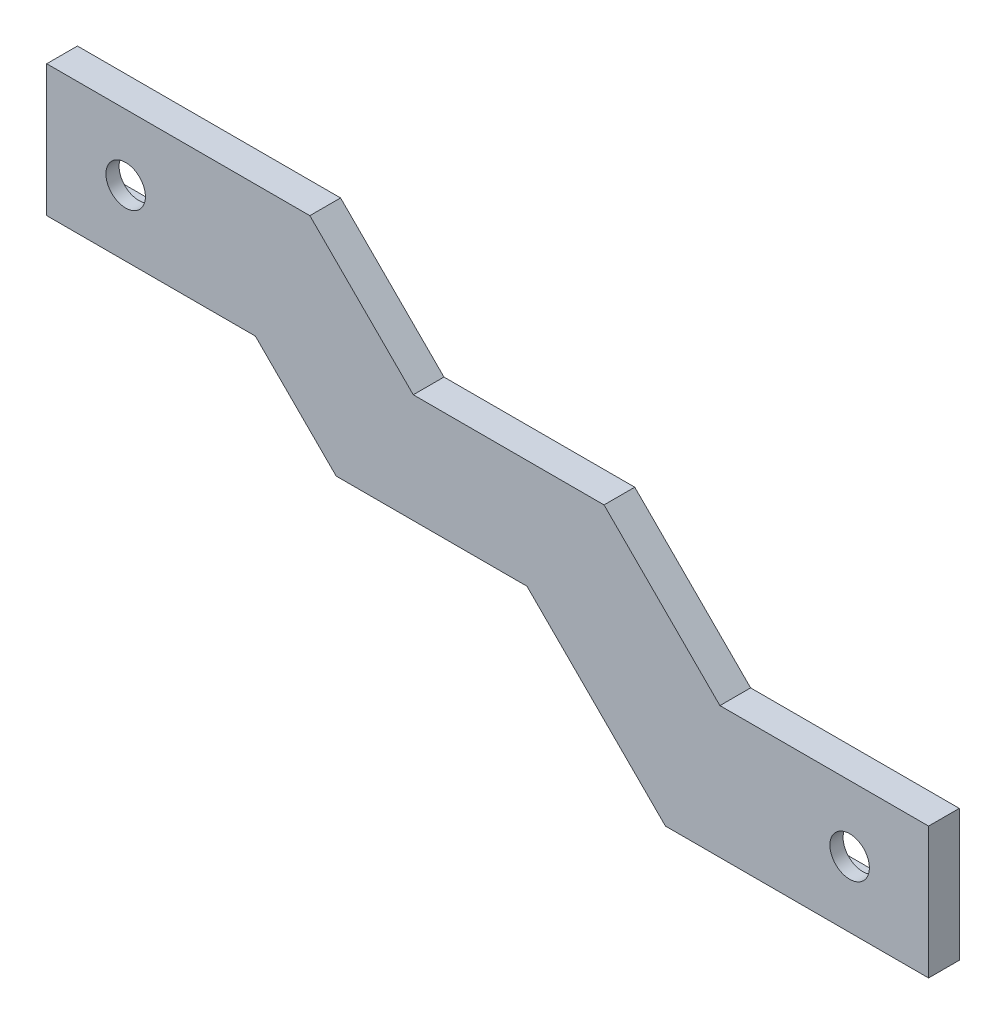
ISO-10303-21;
HEADER;
FILE_DESCRIPTION(('STEP AP214'),'2;1');
FILE_NAME('part.step','',(''),(''),'','','');
FILE_SCHEMA(('AUTOMOTIVE_DESIGN { 1 0 10303 214 1 1 1 1 }'));
ENDSEC;
DATA;
#1=APPLICATION_CONTEXT('core data for automotive mechanical design processes');
#2=APPLICATION_PROTOCOL_DEFINITION('international standard','automotive_design',2000,#1);
#3=PRODUCT_CONTEXT('',#1,'mechanical');
#4=PRODUCT('Part','Part','',(#3));
#5=PRODUCT_RELATED_PRODUCT_CATEGORY('part','',(#4));
#6=PRODUCT_DEFINITION_FORMATION('','',#4);
#7=PRODUCT_DEFINITION_CONTEXT('part definition',#1,'design');
#8=PRODUCT_DEFINITION('design','',#6,#7);
#9=PRODUCT_DEFINITION_SHAPE('','',#8);
#10=(LENGTH_UNIT() NAMED_UNIT(*) SI_UNIT(.MILLI.,.METRE.));
#11=(NAMED_UNIT(*) PLANE_ANGLE_UNIT() SI_UNIT($,.RADIAN.));
#12=(NAMED_UNIT(*) SI_UNIT($,.STERADIAN.) SOLID_ANGLE_UNIT());
#13=UNCERTAINTY_MEASURE_WITH_UNIT(LENGTH_MEASURE(1.E-05),#10,'distance_accuracy_value','');
#14=(GEOMETRIC_REPRESENTATION_CONTEXT(3) GLOBAL_UNCERTAINTY_ASSIGNED_CONTEXT((#13)) GLOBAL_UNIT_ASSIGNED_CONTEXT((#10,
#11,#12)) REPRESENTATION_CONTEXT('',''));
#15=CARTESIAN_POINT('',(0.,0.,0.));
#16=DIRECTION('',(0.,0.,1.));
#17=DIRECTION('',(1.,0.,0.));
#18=AXIS2_PLACEMENT_3D('',#15,#16,#17);
#19=CARTESIAN_POINT('',(0.,0.,0.));
#20=DIRECTION('',(0.,0.,1.));
#21=DIRECTION('',(1.,0.,0.));
#22=AXIS2_PLACEMENT_3D('',#19,#20,#21);
#23=PLANE('',#22);
#24=DIRECTION('',(0.,1.,0.));
#25=VECTOR('',#24,1.);
#26=CARTESIAN_POINT('',(32.7303847577293,21.5,0.));
#27=LINE('',#26,#25);
#28=CARTESIAN_POINT('',(32.7303847577293,21.5,0.));
#29=VERTEX_POINT('',#28);
#30=CARTESIAN_POINT('',(32.7303847577293,28.5,0.));
#31=VERTEX_POINT('',#30);
#32=EDGE_CURVE('E305',#29,#31,#27,.T.);
#33=ORIENTED_EDGE('',*,*,#32,.T.);
#34=DIRECTION('',(-1.,0.,0.));
#35=VECTOR('',#34,1.);
#36=CARTESIAN_POINT('',(32.7303847577293,28.5,0.));
#37=LINE('',#36,#35);
#38=CARTESIAN_POINT('',(15.7303847577293,28.5,0.));
#39=VERTEX_POINT('',#38);
#40=EDGE_CURVE('E322',#31,#39,#37,.T.);
#41=ORIENTED_EDGE('',*,*,#40,.T.);
#42=DIRECTION('',(0.,-1.,0.));
#43=VECTOR('',#42,1.);
#44=CARTESIAN_POINT('',(15.7303847577293,21.5,0.));
#45=LINE('',#44,#43);
#46=CARTESIAN_POINT('',(15.7303847577293,21.5,0.));
#47=VERTEX_POINT('',#46);
#48=EDGE_CURVE('E325',#39,#47,#45,.T.);
#49=ORIENTED_EDGE('',*,*,#48,.T.);
#50=DIRECTION('',(1.,0.,0.));
#51=VECTOR('',#50,1.);
#52=CARTESIAN_POINT('',(32.7303847577293,21.5,0.));
#53=LINE('',#52,#51);
#54=EDGE_CURVE('E310',#47,#29,#53,.T.);
#55=ORIENTED_EDGE('',*,*,#54,.T.);
#56=EDGE_LOOP('',(#33,#41,#49,#55));
#57=FACE_BOUND('',#56,.T.);
#58=DIRECTION('',(0.,1.,0.));
#59=VECTOR('',#58,1.);
#60=CARTESIAN_POINT('',(109.269615242271,-3.49999999999999,0.));
#61=LINE('',#60,#59);
#62=CARTESIAN_POINT('',(109.269615242271,-3.49999999999999,0.));
#63=VERTEX_POINT('',#62);
#64=CARTESIAN_POINT('',(109.269615242271,3.5,0.));
#65=VERTEX_POINT('',#64);
#66=EDGE_CURVE('E271',#63,#65,#61,.T.);
#67=ORIENTED_EDGE('',*,*,#66,.T.);
#68=DIRECTION('',(-1.,0.,0.));
#69=VECTOR('',#68,1.);
#70=CARTESIAN_POINT('',(109.269615242271,3.5,0.));
#71=LINE('',#70,#69);
#72=CARTESIAN_POINT('',(92.2696152422706,3.5,0.));
#73=VERTEX_POINT('',#72);
#74=EDGE_CURVE('E288',#65,#73,#71,.T.);
#75=ORIENTED_EDGE('',*,*,#74,.T.);
#76=DIRECTION('',(0.,-1.,0.));
#77=VECTOR('',#76,1.);
#78=CARTESIAN_POINT('',(92.2696152422706,-3.5,0.));
#79=LINE('',#78,#77);
#80=CARTESIAN_POINT('',(92.2696152422706,-3.5,0.));
#81=VERTEX_POINT('',#80);
#82=EDGE_CURVE('E291',#73,#81,#79,.T.);
#83=ORIENTED_EDGE('',*,*,#82,.T.);
#84=DIRECTION('',(1.,0.,0.));
#85=VECTOR('',#84,1.);
#86=CARTESIAN_POINT('',(109.269615242271,-3.49999999999999,0.));
#87=LINE('',#86,#85);
#88=EDGE_CURVE('E276',#81,#63,#87,.T.);
#89=ORIENTED_EDGE('',*,*,#88,.T.);
#90=EDGE_LOOP('',(#67,#75,#83,#89));
#91=FACE_BOUND('',#90,.T.);
#92=DIRECTION('',(-0.707106781186552,0.707106781186543,0.));
#93=VECTOR('',#92,1.);
#94=CARTESIAN_POINT('',(37.3651923788644,37.3651923788649,0.));
#95=LINE('',#94,#93);
#96=CARTESIAN_POINT('',(54.0203847577294,20.7100000000001,0.));
#97=VERTEX_POINT('',#96);
#98=CARTESIAN_POINT('',(42.2303847577293,32.5,0.));
#99=VERTEX_POINT('',#98);
#100=EDGE_CURVE('E248',#97,#99,#95,.T.);
#101=ORIENTED_EDGE('',*,*,#100,.F.);
#102=DIRECTION('',(-1.,0.,0.));
#103=VECTOR('',#102,1.);
#104=CARTESIAN_POINT('',(0.,20.7100000000001,0.));
#105=LINE('',#104,#103);
#106=CARTESIAN_POINT('',(75.7696152422707,20.7100000000001,0.));
#107=VERTEX_POINT('',#106);
#108=EDGE_CURVE('E246',#107,#97,#105,.T.);
#109=ORIENTED_EDGE('',*,*,#108,.F.);
#110=DIRECTION('',(-0.707106781186546,0.707106781186549,0.));
#111=VECTOR('',#110,1.);
#112=CARTESIAN_POINT('',(48.2398076211355,48.2398076211353,0.));
#113=LINE('',#112,#111);
#114=CARTESIAN_POINT('',(88.9796152422707,7.50000000000003,0.));
#115=VERTEX_POINT('',#114);
#116=EDGE_CURVE('E244',#115,#107,#113,.T.);
#117=ORIENTED_EDGE('',*,*,#116,.F.);
#118=DIRECTION('',(-1.,0.,0.));
#119=VECTOR('',#118,1.);
#120=CARTESIAN_POINT('',(0.,7.50000000000003,0.));
#121=LINE('',#120,#119);
#122=CARTESIAN_POINT('',(112.769615242271,7.50000000000003,0.));
#123=VERTEX_POINT('',#122);
#124=EDGE_CURVE('E242',#123,#115,#121,.T.);
#125=ORIENTED_EDGE('',*,*,#124,.F.);
#126=DIRECTION('',(0.,1.,0.));
#127=VECTOR('',#126,1.);
#128=CARTESIAN_POINT('',(112.769615242271,-7.49999999999999,0.));
#129=LINE('',#128,#127);
#130=CARTESIAN_POINT('',(112.769615242271,-7.49999999999999,0.));
#131=VERTEX_POINT('',#130);
#132=EDGE_CURVE('E339',#131,#123,#129,.T.);
#133=ORIENTED_EDGE('',*,*,#132,.F.);
#134=DIRECTION('',(1.,0.,0.));
#135=VECTOR('',#134,1.);
#136=CARTESIAN_POINT('',(112.769615242271,-7.49999999999999,0.));
#137=LINE('',#136,#135);
#138=CARTESIAN_POINT('',(82.7696152422706,-7.5,0.));
#139=VERTEX_POINT('',#138);
#140=EDGE_CURVE('E347',#139,#131,#137,.T.);
#141=ORIENTED_EDGE('',*,*,#140,.F.);
#142=DIRECTION('',(0.707106781186552,-0.707106781186543,0.));
#143=VECTOR('',#142,1.);
#144=CARTESIAN_POINT('',(37.6348076211348,37.6348076211353,0.));
#145=LINE('',#144,#143);
#146=CARTESIAN_POINT('',(66.9828186778667,8.28679656440374,0.));
#147=VERTEX_POINT('',#146);
#148=EDGE_CURVE('E240',#147,#139,#145,.T.);
#149=ORIENTED_EDGE('',*,*,#148,.F.);
#150=DIRECTION('',(1.,0.,0.));
#151=VECTOR('',#150,1.);
#152=CARTESIAN_POINT('',(0.,8.28679656440372,0.));
#153=LINE('',#152,#151);
#154=CARTESIAN_POINT('',(45.2303847577293,8.28679656440373,0.));
#155=VERTEX_POINT('',#154);
#156=EDGE_CURVE('E238',#155,#147,#153,.T.);
#157=ORIENTED_EDGE('',*,*,#156,.F.);
#158=DIRECTION('',(0.707106781186552,-0.707106781186543,0.));
#159=VECTOR('',#158,1.);
#160=CARTESIAN_POINT('',(26.7585906610663,26.7585906610666,0.));
#161=LINE('',#160,#159);
#162=CARTESIAN_POINT('',(36.0171813221329,17.5,0.));
#163=VERTEX_POINT('',#162);
#164=EDGE_CURVE('E184',#163,#155,#161,.T.);
#165=ORIENTED_EDGE('',*,*,#164,.F.);
#166=DIRECTION('',(1.,0.,0.));
#167=VECTOR('',#166,1.);
#168=CARTESIAN_POINT('',(0.,17.5,0.));
#169=LINE('',#168,#167);
#170=CARTESIAN_POINT('',(12.2303847577293,17.5,0.));
#171=VERTEX_POINT('',#170);
#172=EDGE_CURVE('E220',#171,#163,#169,.T.);
#173=ORIENTED_EDGE('',*,*,#172,.F.);
#174=DIRECTION('',(0.,-1.,0.));
#175=VECTOR('',#174,1.);
#176=CARTESIAN_POINT('',(12.2303847577293,-7.50000000000001,0.));
#177=LINE('',#176,#175);
#178=CARTESIAN_POINT('',(12.2303847577293,32.5,0.));
#179=VERTEX_POINT('',#178);
#180=EDGE_CURVE('E344',#179,#171,#177,.T.);
#181=ORIENTED_EDGE('',*,*,#180,.F.);
#182=DIRECTION('',(-1.,0.,0.));
#183=VECTOR('',#182,1.);
#184=CARTESIAN_POINT('',(112.769615242271,32.5,0.));
#185=LINE('',#184,#183);
#186=EDGE_CURVE('E342',#99,#179,#185,.T.);
#187=ORIENTED_EDGE('',*,*,#186,.F.);
#188=EDGE_LOOP('',(#101,#109,#117,#125,#133,#141,#149,#157,#165,#173,#181,#187));
#189=FACE_BOUND('',#188,.T.);
#190=ADVANCED_FACE('F43',(#57,#91,#189),#23,.F.);
#191=CARTESIAN_POINT('',(112.769615242271,-7.49999999999999,2.));
#192=DIRECTION('',(-1.,0.,0.));
#193=DIRECTION('',(0.,0.,1.));
#194=AXIS2_PLACEMENT_3D('',#191,#192,#193);
#195=PLANE('',#194);
#196=DIRECTION('',(0.,0.,1.));
#197=VECTOR('',#196,1.);
#198=CARTESIAN_POINT('',(112.769615242271,7.50000000000003,-28.));
#199=LINE('',#198,#197);
#200=CARTESIAN_POINT('',(112.769615242271,7.50000000000003,3.5));
#201=VERTEX_POINT('',#200);
#202=EDGE_CURVE('E227',#123,#201,#199,.T.);
#203=ORIENTED_EDGE('',*,*,#202,.T.);
#204=DIRECTION('',(0.,1.,0.));
#205=VECTOR('',#204,1.);
#206=CARTESIAN_POINT('',(112.769615242271,32.5,3.5));
#207=LINE('',#206,#205);
#208=CARTESIAN_POINT('',(112.769615242271,-7.49999999999999,3.5));
#209=VERTEX_POINT('',#208);
#210=EDGE_CURVE('E266',#209,#201,#207,.T.);
#211=ORIENTED_EDGE('',*,*,#210,.F.);
#212=DIRECTION('',(0.,0.,-1.));
#213=VECTOR('',#212,1.);
#214=CARTESIAN_POINT('',(112.769615242271,-7.49999999999999,2.));
#215=LINE('',#214,#213);
#216=EDGE_CURVE('E51',#209,#131,#215,.T.);
#217=ORIENTED_EDGE('',*,*,#216,.T.);
#218=ORIENTED_EDGE('',*,*,#132,.T.);
#219=EDGE_LOOP('',(#203,#211,#217,#218));
#220=FACE_BOUND('',#219,.T.);
#221=ADVANCED_FACE('F45',(#220),#195,.F.);
#222=CARTESIAN_POINT('',(112.769615242271,32.5,2.));
#223=DIRECTION('',(0.,-1.,0.));
#224=DIRECTION('',(1.,0.,0.));
#225=AXIS2_PLACEMENT_3D('',#222,#223,#224);
#226=PLANE('',#225);
#227=DIRECTION('',(0.,0.,1.));
#228=VECTOR('',#227,1.);
#229=CARTESIAN_POINT('',(42.2303847577293,32.5,-28.));
#230=LINE('',#229,#228);
#231=CARTESIAN_POINT('',(42.2303847577293,32.5,3.5));
#232=VERTEX_POINT('',#231);
#233=EDGE_CURVE('E218',#99,#232,#230,.T.);
#234=ORIENTED_EDGE('',*,*,#233,.F.);
#235=ORIENTED_EDGE('',*,*,#186,.T.);
#236=DIRECTION('',(0.,0.,-1.));
#237=VECTOR('',#236,1.);
#238=CARTESIAN_POINT('',(12.2303847577293,32.5,2.));
#239=LINE('',#238,#237);
#240=CARTESIAN_POINT('',(12.2303847577293,32.5,3.5));
#241=VERTEX_POINT('',#240);
#242=EDGE_CURVE('E11',#241,#179,#239,.T.);
#243=ORIENTED_EDGE('',*,*,#242,.F.);
#244=DIRECTION('',(-1.,0.,0.));
#245=VECTOR('',#244,1.);
#246=CARTESIAN_POINT('',(12.2303847577293,32.5,3.5));
#247=LINE('',#246,#245);
#248=EDGE_CURVE('E269',#232,#241,#247,.T.);
#249=ORIENTED_EDGE('',*,*,#248,.F.);
#250=EDGE_LOOP('',(#234,#235,#243,#249));
#251=FACE_BOUND('',#250,.T.);
#252=ADVANCED_FACE('F378',(#251),#226,.F.);
#253=CARTESIAN_POINT('',(12.2303847577293,-7.50000000000001,2.));
#254=DIRECTION('',(1.,0.,0.));
#255=DIRECTION('',(0.,0.,-1.));
#256=AXIS2_PLACEMENT_3D('',#253,#254,#255);
#257=PLANE('',#256);
#258=DIRECTION('',(0.,0.,1.));
#259=VECTOR('',#258,1.);
#260=CARTESIAN_POINT('',(12.2303847577293,17.5,-28.));
#261=LINE('',#260,#259);
#262=CARTESIAN_POINT('',(12.2303847577293,17.5,3.5));
#263=VERTEX_POINT('',#262);
#264=EDGE_CURVE('E217',#171,#263,#261,.T.);
#265=ORIENTED_EDGE('',*,*,#264,.T.);
#266=DIRECTION('',(0.,-1.,0.));
#267=VECTOR('',#266,1.);
#268=CARTESIAN_POINT('',(12.2303847577293,32.5,3.5));
#269=LINE('',#268,#267);
#270=EDGE_CURVE('E260',#241,#263,#269,.T.);
#271=ORIENTED_EDGE('',*,*,#270,.F.);
#272=ORIENTED_EDGE('',*,*,#242,.T.);
#273=ORIENTED_EDGE('',*,*,#180,.T.);
#274=EDGE_LOOP('',(#265,#271,#272,#273));
#275=FACE_BOUND('',#274,.T.);
#276=ADVANCED_FACE('F388',(#275),#257,.F.);
#277=CARTESIAN_POINT('',(112.769615242271,-7.49999999999999,2.));
#278=DIRECTION('',(0.,1.,0.));
#279=DIRECTION('',(-1.,0.,0.));
#280=AXIS2_PLACEMENT_3D('',#277,#278,#279);
#281=PLANE('',#280);
#282=DIRECTION('',(0.,0.,1.));
#283=VECTOR('',#282,1.);
#284=CARTESIAN_POINT('',(82.7696152422706,-7.5,-28.));
#285=LINE('',#284,#283);
#286=CARTESIAN_POINT('',(82.7696152422706,-7.5,3.5));
#287=VERTEX_POINT('',#286);
#288=EDGE_CURVE('E230',#139,#287,#285,.T.);
#289=ORIENTED_EDGE('',*,*,#288,.F.);
#290=ORIENTED_EDGE('',*,*,#140,.T.);
#291=ORIENTED_EDGE('',*,*,#216,.F.);
#292=DIRECTION('',(1.,0.,0.));
#293=VECTOR('',#292,1.);
#294=CARTESIAN_POINT('',(12.2303847577293,-7.49999999999999,3.5));
#295=LINE('',#294,#293);
#296=EDGE_CURVE('E264',#287,#209,#295,.T.);
#297=ORIENTED_EDGE('',*,*,#296,.F.);
#298=EDGE_LOOP('',(#289,#290,#291,#297));
#299=FACE_BOUND('',#298,.T.);
#300=ADVANCED_FACE('F382',(#299),#281,.F.);
#301=CARTESIAN_POINT('',(0.,0.,3.5));
#302=DIRECTION('',(0.,0.,1.));
#303=DIRECTION('',(1.,0.,0.));
#304=AXIS2_PLACEMENT_3D('',#301,#302,#303);
#305=PLANE('',#304);
#306=CARTESIAN_POINT('',(21.2303847577281,25.,3.5));
#307=DIRECTION('',(0.,0.,1.));
#308=DIRECTION('',(1.,0.,0.));
#309=AXIS2_PLACEMENT_3D('',#306,#307,#308);
#310=CIRCLE('',#309,2.25);
#311=CARTESIAN_POINT('',(23.4803847577281,25.,3.5));
#312=VERTEX_POINT('',#311);
#313=EDGE_CURVE('E257',#312,#312,#310,.T.);
#314=ORIENTED_EDGE('',*,*,#313,.F.);
#315=EDGE_LOOP('',(#314));
#316=FACE_BOUND('',#315,.T.);
#317=CARTESIAN_POINT('',(103.769615242269,3.67761376907083E-13,3.5));
#318=DIRECTION('',(0.,0.,1.));
#319=DIRECTION('',(1.,0.,0.));
#320=AXIS2_PLACEMENT_3D('',#317,#318,#319);
#321=CIRCLE('',#320,2.25);
#322=CARTESIAN_POINT('',(106.019615242269,3.67761376907083E-13,3.5));
#323=VERTEX_POINT('',#322);
#324=EDGE_CURVE('E251',#323,#323,#321,.T.);
#325=ORIENTED_EDGE('',*,*,#324,.F.);
#326=EDGE_LOOP('',(#325));
#327=FACE_BOUND('',#326,.T.);
#328=DIRECTION('',(-1.,0.,0.));
#329=VECTOR('',#328,1.);
#330=CARTESIAN_POINT('',(54.0203847577294,20.7100000000001,3.5));
#331=LINE('',#330,#329);
#332=CARTESIAN_POINT('',(75.7696152422707,20.7100000000001,3.5));
#333=VERTEX_POINT('',#332);
#334=CARTESIAN_POINT('',(54.0203847577294,20.7100000000001,3.5));
#335=VERTEX_POINT('',#334);
#336=EDGE_CURVE('E212',#333,#335,#331,.T.);
#337=ORIENTED_EDGE('',*,*,#336,.T.);
#338=DIRECTION('',(-0.707106781186552,0.707106781186543,0.));
#339=VECTOR('',#338,1.);
#340=CARTESIAN_POINT('',(42.2303847577293,32.5,3.5));
#341=LINE('',#340,#339);
#342=EDGE_CURVE('E214',#335,#232,#341,.T.);
#343=ORIENTED_EDGE('',*,*,#342,.T.);
#344=ORIENTED_EDGE('',*,*,#248,.T.);
#345=ORIENTED_EDGE('',*,*,#270,.T.);
#346=DIRECTION('',(1.,0.,0.));
#347=VECTOR('',#346,1.);
#348=CARTESIAN_POINT('',(36.0171813221329,17.5,3.5));
#349=LINE('',#348,#347);
#350=CARTESIAN_POINT('',(36.0171813221329,17.5,3.5));
#351=VERTEX_POINT('',#350);
#352=EDGE_CURVE('E203',#263,#351,#349,.T.);
#353=ORIENTED_EDGE('',*,*,#352,.T.);
#354=DIRECTION('',(0.707106781186552,-0.707106781186543,0.));
#355=VECTOR('',#354,1.);
#356=CARTESIAN_POINT('',(45.2303847577293,8.28679656440373,3.5));
#357=LINE('',#356,#355);
#358=CARTESIAN_POINT('',(45.2303847577293,8.28679656440373,3.5));
#359=VERTEX_POINT('',#358);
#360=EDGE_CURVE('E66',#351,#359,#357,.T.);
#361=ORIENTED_EDGE('',*,*,#360,.T.);
#362=DIRECTION('',(1.,0.,0.));
#363=VECTOR('',#362,1.);
#364=CARTESIAN_POINT('',(66.9828186778667,8.28679656440374,3.5));
#365=LINE('',#364,#363);
#366=CARTESIAN_POINT('',(66.9828186778667,8.28679656440374,3.5));
#367=VERTEX_POINT('',#366);
#368=EDGE_CURVE('E191',#359,#367,#365,.T.);
#369=ORIENTED_EDGE('',*,*,#368,.T.);
#370=DIRECTION('',(0.707106781186552,-0.707106781186543,0.));
#371=VECTOR('',#370,1.);
#372=CARTESIAN_POINT('',(82.7696152422706,-7.5,3.5));
#373=LINE('',#372,#371);
#374=EDGE_CURVE('E197',#367,#287,#373,.T.);
#375=ORIENTED_EDGE('',*,*,#374,.T.);
#376=ORIENTED_EDGE('',*,*,#296,.T.);
#377=ORIENTED_EDGE('',*,*,#210,.T.);
#378=DIRECTION('',(-1.,0.,0.));
#379=VECTOR('',#378,1.);
#380=CARTESIAN_POINT('',(88.9796152422707,7.50000000000003,3.5));
#381=LINE('',#380,#379);
#382=CARTESIAN_POINT('',(88.9796152422707,7.50000000000003,3.5));
#383=VERTEX_POINT('',#382);
#384=EDGE_CURVE('E208',#201,#383,#381,.T.);
#385=ORIENTED_EDGE('',*,*,#384,.T.);
#386=DIRECTION('',(-0.707106781186546,0.707106781186549,0.));
#387=VECTOR('',#386,1.);
#388=CARTESIAN_POINT('',(75.7696152422707,20.7100000000001,3.5));
#389=LINE('',#388,#387);
#390=EDGE_CURVE('E58',#383,#333,#389,.T.);
#391=ORIENTED_EDGE('',*,*,#390,.T.);
#392=EDGE_LOOP('',(#337,#343,#344,#345,#353,#361,#369,#375,#376,#377,#385,#391));
#393=FACE_BOUND('',#392,.T.);
#394=ADVANCED_FACE('F201',(#316,#327,#393),#305,.T.);
#395=CARTESIAN_POINT('',(32.7303847577293,21.5,2.));
#396=DIRECTION('',(-1.,0.,0.));
#397=DIRECTION('',(0.,0.,1.));
#398=AXIS2_PLACEMENT_3D('',#395,#396,#397);
#399=PLANE('',#398);
#400=ORIENTED_EDGE('',*,*,#32,.F.);
#401=DIRECTION('',(0.,0.,-1.));
#402=VECTOR('',#401,1.);
#403=CARTESIAN_POINT('',(32.7303847577293,21.5,2.));
#404=LINE('',#403,#402);
#405=CARTESIAN_POINT('',(32.7303847577293,21.5,2.));
#406=VERTEX_POINT('',#405);
#407=EDGE_CURVE('E319',#406,#29,#404,.T.);
#408=ORIENTED_EDGE('',*,*,#407,.F.);
#409=DIRECTION('',(0.,1.,0.));
#410=VECTOR('',#409,1.);
#411=CARTESIAN_POINT('',(32.7303847577293,21.5,2.));
#412=LINE('',#411,#410);
#413=CARTESIAN_POINT('',(32.7303847577293,28.5,2.));
#414=VERTEX_POINT('',#413);
#415=EDGE_CURVE('E306',#406,#414,#412,.T.);
#416=ORIENTED_EDGE('',*,*,#415,.T.);
#417=DIRECTION('',(0.,0.,-1.));
#418=VECTOR('',#417,1.);
#419=CARTESIAN_POINT('',(32.7303847577293,28.5,2.));
#420=LINE('',#419,#418);
#421=EDGE_CURVE('E336',#414,#31,#420,.T.);
#422=ORIENTED_EDGE('',*,*,#421,.T.);
#423=EDGE_LOOP('',(#400,#408,#416,#422));
#424=FACE_BOUND('',#423,.T.);
#425=ADVANCED_FACE('F411',(#424),#399,.T.);
#426=CARTESIAN_POINT('',(32.7303847577293,28.5,2.));
#427=DIRECTION('',(0.,-1.,0.));
#428=DIRECTION('',(0.,0.,-1.));
#429=AXIS2_PLACEMENT_3D('',#426,#427,#428);
#430=PLANE('',#429);
#431=ORIENTED_EDGE('',*,*,#40,.F.);
#432=ORIENTED_EDGE('',*,*,#421,.F.);
#433=DIRECTION('',(-1.,0.,0.));
#434=VECTOR('',#433,1.);
#435=CARTESIAN_POINT('',(32.7303847577293,28.5,2.));
#436=LINE('',#435,#434);
#437=CARTESIAN_POINT('',(15.7303847577293,28.5,2.));
#438=VERTEX_POINT('',#437);
#439=EDGE_CURVE('E309',#414,#438,#436,.T.);
#440=ORIENTED_EDGE('',*,*,#439,.T.);
#441=DIRECTION('',(0.,0.,-1.));
#442=VECTOR('',#441,1.);
#443=CARTESIAN_POINT('',(15.7303847577293,28.5,2.));
#444=LINE('',#443,#442);
#445=EDGE_CURVE('E334',#438,#39,#444,.T.);
#446=ORIENTED_EDGE('',*,*,#445,.T.);
#447=EDGE_LOOP('',(#431,#432,#440,#446));
#448=FACE_BOUND('',#447,.T.);
#449=ADVANCED_FACE('F614',(#448),#430,.T.);
#450=CARTESIAN_POINT('',(15.7303847577293,21.5,2.));
#451=DIRECTION('',(1.,0.,0.));
#452=DIRECTION('',(0.,0.,-1.));
#453=AXIS2_PLACEMENT_3D('',#450,#451,#452);
#454=PLANE('',#453);
#455=ORIENTED_EDGE('',*,*,#48,.F.);
#456=ORIENTED_EDGE('',*,*,#445,.F.);
#457=DIRECTION('',(0.,-1.,0.));
#458=VECTOR('',#457,1.);
#459=CARTESIAN_POINT('',(15.7303847577293,21.5,2.));
#460=LINE('',#459,#458);
#461=CARTESIAN_POINT('',(15.7303847577293,21.5,2.));
#462=VERTEX_POINT('',#461);
#463=EDGE_CURVE('E313',#438,#462,#460,.T.);
#464=ORIENTED_EDGE('',*,*,#463,.T.);
#465=DIRECTION('',(0.,0.,-1.));
#466=VECTOR('',#465,1.);
#467=CARTESIAN_POINT('',(15.7303847577293,21.5,2.));
#468=LINE('',#467,#466);
#469=EDGE_CURVE('E332',#462,#47,#468,.T.);
#470=ORIENTED_EDGE('',*,*,#469,.T.);
#471=EDGE_LOOP('',(#455,#456,#464,#470));
#472=FACE_BOUND('',#471,.T.);
#473=ADVANCED_FACE('F604',(#472),#454,.T.);
#474=CARTESIAN_POINT('',(32.7303847577293,21.5,2.));
#475=DIRECTION('',(0.,1.,0.));
#476=DIRECTION('',(-1.,0.,0.));
#477=AXIS2_PLACEMENT_3D('',#474,#475,#476);
#478=PLANE('',#477);
#479=ORIENTED_EDGE('',*,*,#54,.F.);
#480=ORIENTED_EDGE('',*,*,#469,.F.);
#481=DIRECTION('',(1.,0.,0.));
#482=VECTOR('',#481,1.);
#483=CARTESIAN_POINT('',(32.7303847577293,21.5,2.));
#484=LINE('',#483,#482);
#485=EDGE_CURVE('E316',#462,#406,#484,.T.);
#486=ORIENTED_EDGE('',*,*,#485,.T.);
#487=ORIENTED_EDGE('',*,*,#407,.T.);
#488=EDGE_LOOP('',(#479,#480,#486,#487));
#489=FACE_BOUND('',#488,.T.);
#490=ADVANCED_FACE('F594',(#489),#478,.T.);
#491=CARTESIAN_POINT('',(109.269615242271,-3.49999999999999,2.));
#492=DIRECTION('',(-1.,0.,0.));
#493=DIRECTION('',(0.,0.,1.));
#494=AXIS2_PLACEMENT_3D('',#491,#492,#493);
#495=PLANE('',#494);
#496=ORIENTED_EDGE('',*,*,#66,.F.);
#497=DIRECTION('',(0.,0.,-1.));
#498=VECTOR('',#497,1.);
#499=CARTESIAN_POINT('',(109.269615242271,-3.49999999999999,2.));
#500=LINE('',#499,#498);
#501=CARTESIAN_POINT('',(109.269615242271,-3.49999999999999,2.));
#502=VERTEX_POINT('',#501);
#503=EDGE_CURVE('E285',#502,#63,#500,.T.);
#504=ORIENTED_EDGE('',*,*,#503,.F.);
#505=DIRECTION('',(0.,1.,0.));
#506=VECTOR('',#505,1.);
#507=CARTESIAN_POINT('',(109.269615242271,-3.49999999999999,2.));
#508=LINE('',#507,#506);
#509=CARTESIAN_POINT('',(109.269615242271,3.5,2.));
#510=VERTEX_POINT('',#509);
#511=EDGE_CURVE('E272',#502,#510,#508,.T.);
#512=ORIENTED_EDGE('',*,*,#511,.T.);
#513=DIRECTION('',(0.,0.,-1.));
#514=VECTOR('',#513,1.);
#515=CARTESIAN_POINT('',(109.269615242271,3.5,2.));
#516=LINE('',#515,#514);
#517=EDGE_CURVE('E302',#510,#65,#516,.T.);
#518=ORIENTED_EDGE('',*,*,#517,.T.);
#519=EDGE_LOOP('',(#496,#504,#512,#518));
#520=FACE_BOUND('',#519,.T.);
#521=ADVANCED_FACE('F584',(#520),#495,.T.);
#522=CARTESIAN_POINT('',(109.269615242271,3.5,2.));
#523=DIRECTION('',(0.,-1.,0.));
#524=DIRECTION('',(0.,0.,-1.));
#525=AXIS2_PLACEMENT_3D('',#522,#523,#524);
#526=PLANE('',#525);
#527=ORIENTED_EDGE('',*,*,#74,.F.);
#528=ORIENTED_EDGE('',*,*,#517,.F.);
#529=DIRECTION('',(-1.,0.,0.));
#530=VECTOR('',#529,1.);
#531=CARTESIAN_POINT('',(109.269615242271,3.5,2.));
#532=LINE('',#531,#530);
#533=CARTESIAN_POINT('',(92.2696152422706,3.5,2.));
#534=VERTEX_POINT('',#533);
#535=EDGE_CURVE('E275',#510,#534,#532,.T.);
#536=ORIENTED_EDGE('',*,*,#535,.T.);
#537=DIRECTION('',(0.,0.,-1.));
#538=VECTOR('',#537,1.);
#539=CARTESIAN_POINT('',(92.2696152422706,3.5,2.));
#540=LINE('',#539,#538);
#541=EDGE_CURVE('E300',#534,#73,#540,.T.);
#542=ORIENTED_EDGE('',*,*,#541,.T.);
#543=EDGE_LOOP('',(#527,#528,#536,#542));
#544=FACE_BOUND('',#543,.T.);
#545=ADVANCED_FACE('F574',(#544),#526,.T.);
#546=CARTESIAN_POINT('',(92.2696152422706,-3.5,2.));
#547=DIRECTION('',(1.,0.,0.));
#548=DIRECTION('',(0.,0.,-1.));
#549=AXIS2_PLACEMENT_3D('',#546,#547,#548);
#550=PLANE('',#549);
#551=ORIENTED_EDGE('',*,*,#82,.F.);
#552=ORIENTED_EDGE('',*,*,#541,.F.);
#553=DIRECTION('',(0.,-1.,0.));
#554=VECTOR('',#553,1.);
#555=CARTESIAN_POINT('',(92.2696152422706,-3.5,2.));
#556=LINE('',#555,#554);
#557=CARTESIAN_POINT('',(92.2696152422706,-3.5,2.));
#558=VERTEX_POINT('',#557);
#559=EDGE_CURVE('E279',#534,#558,#556,.T.);
#560=ORIENTED_EDGE('',*,*,#559,.T.);
#561=DIRECTION('',(0.,0.,-1.));
#562=VECTOR('',#561,1.);
#563=CARTESIAN_POINT('',(92.2696152422706,-3.5,2.));
#564=LINE('',#563,#562);
#565=EDGE_CURVE('E298',#558,#81,#564,.T.);
#566=ORIENTED_EDGE('',*,*,#565,.T.);
#567=EDGE_LOOP('',(#551,#552,#560,#566));
#568=FACE_BOUND('',#567,.T.);
#569=ADVANCED_FACE('F564',(#568),#550,.T.);
#570=CARTESIAN_POINT('',(109.269615242271,-3.49999999999999,2.));
#571=DIRECTION('',(0.,1.,0.));
#572=DIRECTION('',(-1.,0.,0.));
#573=AXIS2_PLACEMENT_3D('',#570,#571,#572);
#574=PLANE('',#573);
#575=ORIENTED_EDGE('',*,*,#88,.F.);
#576=ORIENTED_EDGE('',*,*,#565,.F.);
#577=DIRECTION('',(1.,0.,0.));
#578=VECTOR('',#577,1.);
#579=CARTESIAN_POINT('',(109.269615242271,-3.49999999999999,2.));
#580=LINE('',#579,#578);
#581=EDGE_CURVE('E282',#558,#502,#580,.T.);
#582=ORIENTED_EDGE('',*,*,#581,.T.);
#583=ORIENTED_EDGE('',*,*,#503,.T.);
#584=EDGE_LOOP('',(#575,#576,#582,#583));
#585=FACE_BOUND('',#584,.T.);
#586=ADVANCED_FACE('F555',(#585),#574,.T.);
#587=CARTESIAN_POINT('',(0.,0.,2.));
#588=DIRECTION('',(0.,0.,1.));
#589=DIRECTION('',(1.,0.,0.));
#590=AXIS2_PLACEMENT_3D('',#587,#588,#589);
#591=PLANE('',#590);
#592=ORIENTED_EDGE('',*,*,#439,.F.);
#593=ORIENTED_EDGE('',*,*,#415,.F.);
#594=ORIENTED_EDGE('',*,*,#485,.F.);
#595=ORIENTED_EDGE('',*,*,#463,.F.);
#596=EDGE_LOOP('',(#592,#593,#594,#595));
#597=FACE_BOUND('',#596,.T.);
#598=CARTESIAN_POINT('',(21.2303847577281,25.,2.));
#599=DIRECTION('',(0.,0.,1.));
#600=DIRECTION('',(1.,0.,0.));
#601=AXIS2_PLACEMENT_3D('',#598,#599,#600);
#602=CIRCLE('',#601,2.25);
#603=CARTESIAN_POINT('',(23.4803847577281,25.,2.));
#604=VERTEX_POINT('',#603);
#605=EDGE_CURVE('E254',#604,#604,#602,.T.);
#606=ORIENTED_EDGE('',*,*,#605,.T.);
#607=EDGE_LOOP('',(#606));
#608=FACE_BOUND('',#607,.T.);
#609=ADVANCED_FACE('F545',(#597,#608),#591,.F.);
#610=ORIENTED_EDGE('',*,*,#535,.F.);
#611=ORIENTED_EDGE('',*,*,#511,.F.);
#612=ORIENTED_EDGE('',*,*,#581,.F.);
#613=ORIENTED_EDGE('',*,*,#559,.F.);
#614=EDGE_LOOP('',(#610,#611,#612,#613));
#615=FACE_BOUND('',#614,.T.);
#616=CARTESIAN_POINT('',(103.769615242269,3.67761376907083E-13,2.));
#617=DIRECTION('',(0.,0.,1.));
#618=DIRECTION('',(1.,0.,0.));
#619=AXIS2_PLACEMENT_3D('',#616,#617,#618);
#620=CIRCLE('',#619,2.25);
#621=CARTESIAN_POINT('',(106.019615242269,3.67761376907083E-13,2.));
#622=VERTEX_POINT('',#621);
#623=EDGE_CURVE('E250',#622,#622,#620,.T.);
#624=ORIENTED_EDGE('',*,*,#623,.T.);
#625=EDGE_LOOP('',(#624));
#626=FACE_BOUND('',#625,.T.);
#627=ADVANCED_FACE('F535',(#615,#626),#591,.F.);
#628=CARTESIAN_POINT('',(21.2303847577281,25.,3.5));
#629=DIRECTION('',(0.,0.,-1.));
#630=DIRECTION('',(-1.,0.,0.));
#631=AXIS2_PLACEMENT_3D('',#628,#629,#630);
#632=CYLINDRICAL_SURFACE('',#631,2.25);
#633=ORIENTED_EDGE('',*,*,#313,.T.);
#634=EDGE_LOOP('',(#633));
#635=FACE_BOUND('',#634,.T.);
#636=ORIENTED_EDGE('',*,*,#605,.F.);
#637=EDGE_LOOP('',(#636));
#638=FACE_BOUND('',#637,.T.);
#639=ADVANCED_FACE('F399',(#635,#638),#632,.F.);
#640=CARTESIAN_POINT('',(103.769615242269,3.67761376907083E-13,3.5));
#641=DIRECTION('',(0.,0.,-1.));
#642=DIRECTION('',(-1.,0.,0.));
#643=AXIS2_PLACEMENT_3D('',#640,#641,#642);
#644=CYLINDRICAL_SURFACE('',#643,2.25);
#645=ORIENTED_EDGE('',*,*,#324,.T.);
#646=EDGE_LOOP('',(#645));
#647=FACE_BOUND('',#646,.T.);
#648=ORIENTED_EDGE('',*,*,#623,.F.);
#649=EDGE_LOOP('',(#648));
#650=FACE_BOUND('',#649,.T.);
#651=ADVANCED_FACE('F391',(#647,#650),#644,.F.);
#652=CARTESIAN_POINT('',(36.0171813221329,17.5,-28.));
#653=DIRECTION('',(0.,-1.,0.));
#654=DIRECTION('',(1.,0.,0.));
#655=AXIS2_PLACEMENT_3D('',#652,#653,#654);
#656=PLANE('',#655);
#657=ORIENTED_EDGE('',*,*,#172,.T.);
#658=DIRECTION('',(0.,0.,1.));
#659=VECTOR('',#658,1.);
#660=CARTESIAN_POINT('',(36.0171813221329,17.5,-28.));
#661=LINE('',#660,#659);
#662=EDGE_CURVE('E188',#163,#351,#661,.T.);
#663=ORIENTED_EDGE('',*,*,#662,.T.);
#664=ORIENTED_EDGE('',*,*,#352,.F.);
#665=ORIENTED_EDGE('',*,*,#264,.F.);
#666=EDGE_LOOP('',(#657,#663,#664,#665));
#667=FACE_BOUND('',#666,.T.);
#668=ADVANCED_FACE('F389',(#667),#656,.T.);
#669=CARTESIAN_POINT('',(45.2303847577293,8.28679656440373,-28.));
#670=DIRECTION('',(-0.707106781186543,-0.707106781186552,0.));
#671=DIRECTION('',(0.707106781186552,-0.707106781186543,0.));
#672=AXIS2_PLACEMENT_3D('',#669,#670,#671);
#673=PLANE('',#672);
#674=ORIENTED_EDGE('',*,*,#164,.T.);
#675=DIRECTION('',(0.,0.,1.));
#676=VECTOR('',#675,1.);
#677=CARTESIAN_POINT('',(45.2303847577293,8.28679656440373,-28.));
#678=LINE('',#677,#676);
#679=EDGE_CURVE('E180',#155,#359,#678,.T.);
#680=ORIENTED_EDGE('',*,*,#679,.T.);
#681=ORIENTED_EDGE('',*,*,#360,.F.);
#682=ORIENTED_EDGE('',*,*,#662,.F.);
#683=EDGE_LOOP('',(#674,#680,#681,#682));
#684=FACE_BOUND('',#683,.T.);
#685=ADVANCED_FACE('F182',(#684),#673,.T.);
#686=CARTESIAN_POINT('',(66.9828186778667,8.28679656440374,-28.));
#687=DIRECTION('',(0.,-1.,0.));
#688=DIRECTION('',(1.,0.,0.));
#689=AXIS2_PLACEMENT_3D('',#686,#687,#688);
#690=PLANE('',#689);
#691=ORIENTED_EDGE('',*,*,#156,.T.);
#692=DIRECTION('',(0.,0.,1.));
#693=VECTOR('',#692,1.);
#694=CARTESIAN_POINT('',(66.9828186778667,8.28679656440374,-28.));
#695=LINE('',#694,#693);
#696=EDGE_CURVE('E187',#147,#367,#695,.T.);
#697=ORIENTED_EDGE('',*,*,#696,.T.);
#698=ORIENTED_EDGE('',*,*,#368,.F.);
#699=ORIENTED_EDGE('',*,*,#679,.F.);
#700=EDGE_LOOP('',(#691,#697,#698,#699));
#701=FACE_BOUND('',#700,.T.);
#702=ADVANCED_FACE('F192',(#701),#690,.T.);
#703=CARTESIAN_POINT('',(82.7696152422706,-7.5,-28.));
#704=DIRECTION('',(-0.707106781186543,-0.707106781186552,0.));
#705=DIRECTION('',(0.707106781186552,-0.707106781186543,0.));
#706=AXIS2_PLACEMENT_3D('',#703,#704,#705);
#707=PLANE('',#706);
#708=ORIENTED_EDGE('',*,*,#148,.T.);
#709=ORIENTED_EDGE('',*,*,#288,.T.);
#710=ORIENTED_EDGE('',*,*,#374,.F.);
#711=ORIENTED_EDGE('',*,*,#696,.F.);
#712=EDGE_LOOP('',(#708,#709,#710,#711));
#713=FACE_BOUND('',#712,.T.);
#714=ADVANCED_FACE('F384',(#713),#707,.T.);
#715=CARTESIAN_POINT('',(42.2303847577293,32.5,-28.));
#716=DIRECTION('',(0.707106781186543,0.707106781186552,0.));
#717=DIRECTION('',(-0.707106781186552,0.707106781186543,0.));
#718=AXIS2_PLACEMENT_3D('',#715,#716,#717);
#719=PLANE('',#718);
#720=ORIENTED_EDGE('',*,*,#100,.T.);
#721=ORIENTED_EDGE('',*,*,#233,.T.);
#722=ORIENTED_EDGE('',*,*,#342,.F.);
#723=DIRECTION('',(0.,0.,1.));
#724=VECTOR('',#723,1.);
#725=CARTESIAN_POINT('',(54.0203847577294,20.7100000000001,-28.));
#726=LINE('',#725,#724);
#727=EDGE_CURVE('E221',#97,#335,#726,.T.);
#728=ORIENTED_EDGE('',*,*,#727,.F.);
#729=EDGE_LOOP('',(#720,#721,#722,#728));
#730=FACE_BOUND('',#729,.T.);
#731=ADVANCED_FACE('F374',(#730),#719,.T.);
#732=CARTESIAN_POINT('',(54.0203847577294,20.7100000000001,-28.));
#733=DIRECTION('',(0.,1.,0.));
#734=DIRECTION('',(0.,0.,1.));
#735=AXIS2_PLACEMENT_3D('',#732,#733,#734);
#736=PLANE('',#735);
#737=ORIENTED_EDGE('',*,*,#108,.T.);
#738=ORIENTED_EDGE('',*,*,#727,.T.);
#739=ORIENTED_EDGE('',*,*,#336,.F.);
#740=DIRECTION('',(0.,0.,1.));
#741=VECTOR('',#740,1.);
#742=CARTESIAN_POINT('',(75.7696152422707,20.7100000000001,-28.));
#743=LINE('',#742,#741);
#744=EDGE_CURVE('E223',#107,#333,#743,.T.);
#745=ORIENTED_EDGE('',*,*,#744,.F.);
#746=EDGE_LOOP('',(#737,#738,#739,#745));
#747=FACE_BOUND('',#746,.T.);
#748=ADVANCED_FACE('F368',(#747),#736,.T.);
#749=CARTESIAN_POINT('',(75.7696152422707,20.7100000000001,-28.));
#750=DIRECTION('',(0.707106781186549,0.707106781186546,0.));
#751=DIRECTION('',(-0.707106781186546,0.707106781186549,0.));
#752=AXIS2_PLACEMENT_3D('',#749,#750,#751);
#753=PLANE('',#752);
#754=ORIENTED_EDGE('',*,*,#116,.T.);
#755=ORIENTED_EDGE('',*,*,#744,.T.);
#756=ORIENTED_EDGE('',*,*,#390,.F.);
#757=DIRECTION('',(0.,0.,1.));
#758=VECTOR('',#757,1.);
#759=CARTESIAN_POINT('',(88.9796152422707,7.50000000000003,-28.));
#760=LINE('',#759,#758);
#761=EDGE_CURVE('E225',#115,#383,#760,.T.);
#762=ORIENTED_EDGE('',*,*,#761,.F.);
#763=EDGE_LOOP('',(#754,#755,#756,#762));
#764=FACE_BOUND('',#763,.T.);
#765=ADVANCED_FACE('F364',(#764),#753,.T.);
#766=CARTESIAN_POINT('',(88.9796152422707,7.50000000000003,-28.));
#767=DIRECTION('',(0.,1.,0.));
#768=DIRECTION('',(-1.,0.,0.));
#769=AXIS2_PLACEMENT_3D('',#766,#767,#768);
#770=PLANE('',#769);
#771=ORIENTED_EDGE('',*,*,#124,.T.);
#772=ORIENTED_EDGE('',*,*,#761,.T.);
#773=ORIENTED_EDGE('',*,*,#384,.F.);
#774=ORIENTED_EDGE('',*,*,#202,.F.);
#775=EDGE_LOOP('',(#771,#772,#773,#774));
#776=FACE_BOUND('',#775,.T.);
#777=ADVANCED_FACE('F363',(#776),#770,.T.);
#778=CLOSED_SHELL('',(#190,#221,#252,#276,#300,#394,#425,#449,#473,#490,#521,#545,#569,#586,
#609,#627,#639,#651,#668,#685,#702,#714,#731,#748,#765,#777));
#779=MANIFOLD_SOLID_BREP('B2',#778);
#780=ADVANCED_BREP_SHAPE_REPRESENTATION('',(#18,#779),#14);
#781=SHAPE_DEFINITION_REPRESENTATION(#9,#780);
ENDSEC;
END-ISO-10303-21;
